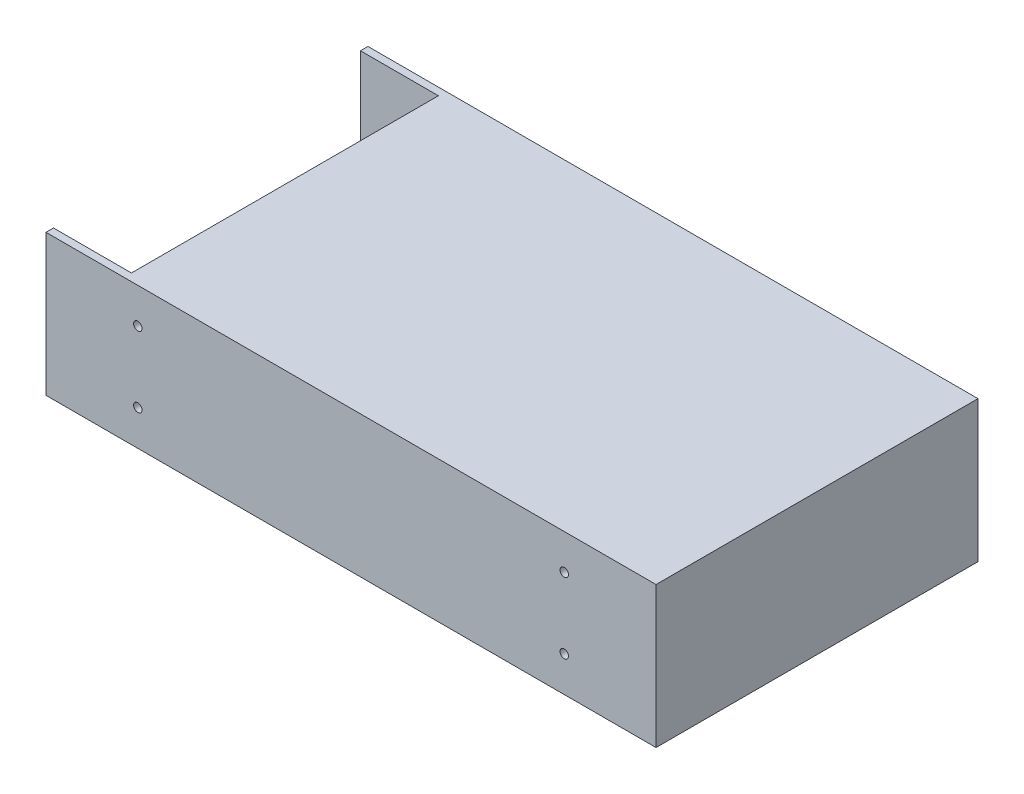
ISO-10303-21;
HEADER;
FILE_DESCRIPTION(('STEP AP214'),'2;1');
FILE_NAME('part.step','',(''),(''),'','','');
FILE_SCHEMA(('AUTOMOTIVE_DESIGN { 1 0 10303 214 1 1 1 1 }'));
ENDSEC;
DATA;
#1=APPLICATION_CONTEXT('core data for automotive mechanical design processes');
#2=APPLICATION_PROTOCOL_DEFINITION('international standard','automotive_design',2000,#1);
#3=PRODUCT_CONTEXT('',#1,'mechanical');
#4=PRODUCT('Part','Part','',(#3));
#5=PRODUCT_RELATED_PRODUCT_CATEGORY('part','',(#4));
#6=PRODUCT_DEFINITION_FORMATION('','',#4);
#7=PRODUCT_DEFINITION_CONTEXT('part definition',#1,'design');
#8=PRODUCT_DEFINITION('design','',#6,#7);
#9=PRODUCT_DEFINITION_SHAPE('','',#8);
#10=(LENGTH_UNIT() NAMED_UNIT(*) SI_UNIT(.MILLI.,.METRE.));
#11=(NAMED_UNIT(*) PLANE_ANGLE_UNIT() SI_UNIT($,.RADIAN.));
#12=(NAMED_UNIT(*) SI_UNIT($,.STERADIAN.) SOLID_ANGLE_UNIT());
#13=UNCERTAINTY_MEASURE_WITH_UNIT(LENGTH_MEASURE(1.E-05),#10,'distance_accuracy_value','');
#14=(GEOMETRIC_REPRESENTATION_CONTEXT(3) GLOBAL_UNCERTAINTY_ASSIGNED_CONTEXT((#13)) GLOBAL_UNIT_ASSIGNED_CONTEXT((#10,
#11,#12)) REPRESENTATION_CONTEXT('',''));
#15=CARTESIAN_POINT('',(0.,0.,0.));
#16=DIRECTION('',(0.,0.,1.));
#17=DIRECTION('',(1.,0.,0.));
#18=AXIS2_PLACEMENT_3D('',#15,#16,#17);
#19=CARTESIAN_POINT('',(0.,6.00000000000001,0.));
#20=DIRECTION('',(0.,1.,0.));
#21=DIRECTION('',(0.,0.,1.));
#22=AXIS2_PLACEMENT_3D('',#19,#20,#21);
#23=PLANE('',#22);
#24=DIRECTION('',(0.,0.,1.));
#25=VECTOR('',#24,1.);
#26=CARTESIAN_POINT('',(-108.,6.00000000000001,-54.3417067177277));
#27=LINE('',#26,#25);
#28=CARTESIAN_POINT('',(-108.,6.00000000000001,-54.3417067177277));
#29=VERTEX_POINT('',#28);
#30=CARTESIAN_POINT('',(-108.,6.00000000000001,54.3417067177274));
#31=VERTEX_POINT('',#30);
#32=EDGE_CURVE('E158',#29,#31,#27,.T.);
#33=ORIENTED_EDGE('',*,*,#32,.T.);
#34=DIRECTION('',(1.,0.,0.));
#35=VECTOR('',#34,1.);
#36=CARTESIAN_POINT('',(-108.,6.00000000000001,54.3417067177274));
#37=LINE('',#36,#35);
#38=CARTESIAN_POINT('',(-80.4048754072851,6.00000000000001,54.3417067177274));
#39=VERTEX_POINT('',#38);
#40=EDGE_CURVE('E161',#31,#39,#37,.T.);
#41=ORIENTED_EDGE('',*,*,#40,.T.);
#42=DIRECTION('',(0.,0.,-1.));
#43=VECTOR('',#42,1.);
#44=CARTESIAN_POINT('',(-80.4048754072851,6.00000000000001,-54.3417067177277));
#45=LINE('',#44,#43);
#46=CARTESIAN_POINT('',(-80.4048754072851,6.00000000000001,-54.3417067177277));
#47=VERTEX_POINT('',#46);
#48=EDGE_CURVE('E165',#39,#47,#45,.T.);
#49=ORIENTED_EDGE('',*,*,#48,.T.);
#50=DIRECTION('',(-1.,0.,0.));
#51=VECTOR('',#50,1.);
#52=CARTESIAN_POINT('',(-108.,6.00000000000001,-54.3417067177277));
#53=LINE('',#52,#51);
#54=EDGE_CURVE('E168',#47,#29,#53,.T.);
#55=ORIENTED_EDGE('',*,*,#54,.T.);
#56=EDGE_LOOP('',(#33,#41,#49,#55));
#57=FACE_BOUND('',#56,.T.);
#58=DIRECTION('',(1.,0.,0.));
#59=VECTOR('',#58,1.);
#60=CARTESIAN_POINT('',(-102.297937106513,6.00000000000001,47.5652828584427));
#61=LINE('',#60,#59);
#62=CARTESIAN_POINT('',(-102.297937106513,6.00000000000001,47.5652828584427));
#63=VERTEX_POINT('',#62);
#64=CARTESIAN_POINT('',(-86.9206675796744,6.00000000000001,47.5652828584427));
#65=VERTEX_POINT('',#64);
#66=EDGE_CURVE('E304',#63,#65,#61,.T.);
#67=ORIENTED_EDGE('',*,*,#66,.F.);
#68=DIRECTION('',(0.,0.,1.));
#69=VECTOR('',#68,1.);
#70=CARTESIAN_POINT('',(-102.297937106513,6.00000000000001,-47.825914545338));
#71=LINE('',#70,#69);
#72=CARTESIAN_POINT('',(-102.297937106513,6.00000000000001,-47.825914545338));
#73=VERTEX_POINT('',#72);
#74=EDGE_CURVE('E149',#73,#63,#71,.T.);
#75=ORIENTED_EDGE('',*,*,#74,.F.);
#76=DIRECTION('',(-1.,0.,0.));
#77=VECTOR('',#76,1.);
#78=CARTESIAN_POINT('',(-102.297937106513,6.00000000000001,-47.825914545338));
#79=LINE('',#78,#77);
#80=CARTESIAN_POINT('',(-86.9206675796744,6.00000000000001,-47.825914545338));
#81=VERTEX_POINT('',#80);
#82=EDGE_CURVE('E145',#81,#73,#79,.T.);
#83=ORIENTED_EDGE('',*,*,#82,.F.);
#84=DIRECTION('',(0.,0.,-1.));
#85=VECTOR('',#84,1.);
#86=CARTESIAN_POINT('',(-86.9206675796744,6.00000000000001,-47.825914545338));
#87=LINE('',#86,#85);
#88=EDGE_CURVE('E306',#65,#81,#87,.T.);
#89=ORIENTED_EDGE('',*,*,#88,.F.);
#90=EDGE_LOOP('',(#67,#75,#83,#89));
#91=FACE_BOUND('',#90,.T.);
#92=ADVANCED_FACE('F36',(#57,#91),#23,.T.);
#93=CARTESIAN_POINT('',(-108.,50.,-57.));
#94=DIRECTION('',(1.,0.,0.));
#95=DIRECTION('',(0.,0.,-1.));
#96=AXIS2_PLACEMENT_3D('',#93,#94,#95);
#97=PLANE('',#96);
#98=ORIENTED_EDGE('',*,*,#32,.F.);
#99=DIRECTION('',(0.,1.,0.));
#100=VECTOR('',#99,1.);
#101=CARTESIAN_POINT('',(-108.,6.00000000000001,-54.3417067177277));
#102=LINE('',#101,#100);
#103=CARTESIAN_POINT('',(-108.,50.,-54.3417067177277));
#104=VERTEX_POINT('',#103);
#105=EDGE_CURVE('E174',#29,#104,#102,.T.);
#106=ORIENTED_EDGE('',*,*,#105,.T.);
#107=DIRECTION('',(0.,0.,1.));
#108=VECTOR('',#107,1.);
#109=CARTESIAN_POINT('',(-108.,50.,-57.));
#110=LINE('',#109,#108);
#111=CARTESIAN_POINT('',(-108.,50.,-57.));
#112=VERTEX_POINT('',#111);
#113=EDGE_CURVE('E183',#112,#104,#110,.T.);
#114=ORIENTED_EDGE('',*,*,#113,.F.);
#115=DIRECTION('',(0.,-1.,0.));
#116=VECTOR('',#115,1.);
#117=CARTESIAN_POINT('',(-108.,50.,-57.));
#118=LINE('',#117,#116);
#119=CARTESIAN_POINT('',(-108.,0.,-57.));
#120=VERTEX_POINT('',#119);
#121=EDGE_CURVE('E193',#112,#120,#118,.T.);
#122=ORIENTED_EDGE('',*,*,#121,.T.);
#123=DIRECTION('',(0.,0.,1.));
#124=VECTOR('',#123,1.);
#125=CARTESIAN_POINT('',(-108.,0.,-57.));
#126=LINE('',#125,#124);
#127=CARTESIAN_POINT('',(-108.,0.,57.));
#128=VERTEX_POINT('',#127);
#129=EDGE_CURVE('E177',#120,#128,#126,.T.);
#130=ORIENTED_EDGE('',*,*,#129,.T.);
#131=DIRECTION('',(0.,-1.,0.));
#132=VECTOR('',#131,1.);
#133=CARTESIAN_POINT('',(-108.,50.,57.));
#134=LINE('',#133,#132);
#135=CARTESIAN_POINT('',(-108.,50.,57.));
#136=VERTEX_POINT('',#135);
#137=EDGE_CURVE('E11',#136,#128,#134,.T.);
#138=ORIENTED_EDGE('',*,*,#137,.F.);
#139=CARTESIAN_POINT('',(-108.,50.,54.3417067177274));
#140=VERTEX_POINT('',#139);
#141=EDGE_CURVE('E187',#140,#136,#110,.T.);
#142=ORIENTED_EDGE('',*,*,#141,.F.);
#143=DIRECTION('',(0.,1.,0.));
#144=VECTOR('',#143,1.);
#145=CARTESIAN_POINT('',(-108.,6.00000000000001,54.3417067177274));
#146=LINE('',#145,#144);
#147=EDGE_CURVE('E59',#31,#140,#146,.T.);
#148=ORIENTED_EDGE('',*,*,#147,.F.);
#149=EDGE_LOOP('',(#98,#106,#114,#122,#130,#138,#142,#148));
#150=FACE_BOUND('',#149,.T.);
#151=ADVANCED_FACE('F38',(#150),#97,.F.);
#152=CARTESIAN_POINT('',(-108.,50.,57.));
#153=DIRECTION('',(0.,0.,-1.));
#154=DIRECTION('',(-1.,0.,0.));
#155=AXIS2_PLACEMENT_3D('',#152,#153,#154);
#156=PLANE('',#155);
#157=CARTESIAN_POINT('',(-75.5,37.5,57.));
#158=DIRECTION('',(0.,0.,1.));
#159=DIRECTION('',(1.,0.,0.));
#160=AXIS2_PLACEMENT_3D('',#157,#158,#159);
#161=CIRCLE('',#160,1.5);
#162=CARTESIAN_POINT('',(-74.,37.5,57.));
#163=VERTEX_POINT('',#162);
#164=EDGE_CURVE('E278',#163,#163,#161,.T.);
#165=ORIENTED_EDGE('',*,*,#164,.F.);
#166=EDGE_LOOP('',(#165));
#167=FACE_BOUND('',#166,.T.);
#168=CARTESIAN_POINT('',(-75.5,12.5,57.));
#169=DIRECTION('',(0.,0.,1.));
#170=DIRECTION('',(1.,0.,0.));
#171=AXIS2_PLACEMENT_3D('',#168,#169,#170);
#172=CIRCLE('',#171,1.5);
#173=CARTESIAN_POINT('',(-74.,12.5,57.));
#174=VERTEX_POINT('',#173);
#175=EDGE_CURVE('E282',#174,#174,#172,.T.);
#176=ORIENTED_EDGE('',*,*,#175,.F.);
#177=EDGE_LOOP('',(#176));
#178=FACE_BOUND('',#177,.T.);
#179=CARTESIAN_POINT('',(75.5,12.5,57.));
#180=DIRECTION('',(0.,0.,1.));
#181=DIRECTION('',(1.,0.,0.));
#182=AXIS2_PLACEMENT_3D('',#179,#180,#181);
#183=CIRCLE('',#182,1.5);
#184=CARTESIAN_POINT('',(77.,12.5,57.));
#185=VERTEX_POINT('',#184);
#186=EDGE_CURVE('E286',#185,#185,#183,.T.);
#187=ORIENTED_EDGE('',*,*,#186,.F.);
#188=EDGE_LOOP('',(#187));
#189=FACE_BOUND('',#188,.T.);
#190=CARTESIAN_POINT('',(75.5,37.5,57.));
#191=DIRECTION('',(0.,0.,1.));
#192=DIRECTION('',(1.,0.,0.));
#193=AXIS2_PLACEMENT_3D('',#190,#191,#192);
#194=CIRCLE('',#193,1.5);
#195=CARTESIAN_POINT('',(77.,37.5,57.));
#196=VERTEX_POINT('',#195);
#197=EDGE_CURVE('E289',#196,#196,#194,.T.);
#198=ORIENTED_EDGE('',*,*,#197,.F.);
#199=EDGE_LOOP('',(#198));
#200=FACE_BOUND('',#199,.T.);
#201=DIRECTION('',(1.,0.,0.));
#202=VECTOR('',#201,1.);
#203=CARTESIAN_POINT('',(-108.,0.,57.));
#204=LINE('',#203,#202);
#205=CARTESIAN_POINT('',(108.,0.,57.));
#206=VERTEX_POINT('',#205);
#207=EDGE_CURVE('E196',#128,#206,#204,.T.);
#208=ORIENTED_EDGE('',*,*,#207,.T.);
#209=DIRECTION('',(0.,-1.,0.));
#210=VECTOR('',#209,1.);
#211=CARTESIAN_POINT('',(108.,50.,57.));
#212=LINE('',#211,#210);
#213=CARTESIAN_POINT('',(108.,50.,57.));
#214=VERTEX_POINT('',#213);
#215=EDGE_CURVE('E44',#214,#206,#212,.T.);
#216=ORIENTED_EDGE('',*,*,#215,.F.);
#217=DIRECTION('',(1.,0.,0.));
#218=VECTOR('',#217,1.);
#219=CARTESIAN_POINT('',(-108.,50.,57.));
#220=LINE('',#219,#218);
#221=EDGE_CURVE('E186',#136,#214,#220,.T.);
#222=ORIENTED_EDGE('',*,*,#221,.F.);
#223=ORIENTED_EDGE('',*,*,#137,.T.);
#224=EDGE_LOOP('',(#208,#216,#222,#223));
#225=FACE_BOUND('',#224,.T.);
#226=ADVANCED_FACE('F232',(#167,#178,#189,#200,#225),#156,.F.);
#227=CARTESIAN_POINT('',(108.,50.,-57.));
#228=DIRECTION('',(-1.,0.,0.));
#229=DIRECTION('',(0.,0.,1.));
#230=AXIS2_PLACEMENT_3D('',#227,#228,#229);
#231=PLANE('',#230);
#232=DIRECTION('',(0.,0.,-1.));
#233=VECTOR('',#232,1.);
#234=CARTESIAN_POINT('',(108.,0.,-57.));
#235=LINE('',#234,#233);
#236=CARTESIAN_POINT('',(108.,0.,-57.));
#237=VERTEX_POINT('',#236);
#238=EDGE_CURVE('E198',#206,#237,#235,.T.);
#239=ORIENTED_EDGE('',*,*,#238,.T.);
#240=DIRECTION('',(0.,-1.,0.));
#241=VECTOR('',#240,1.);
#242=CARTESIAN_POINT('',(108.,50.,-57.));
#243=LINE('',#242,#241);
#244=CARTESIAN_POINT('',(108.,50.,-57.));
#245=VERTEX_POINT('',#244);
#246=EDGE_CURVE('E204',#245,#237,#243,.T.);
#247=ORIENTED_EDGE('',*,*,#246,.F.);
#248=DIRECTION('',(0.,0.,-1.));
#249=VECTOR('',#248,1.);
#250=CARTESIAN_POINT('',(108.,50.,-57.));
#251=LINE('',#250,#249);
#252=EDGE_CURVE('E189',#214,#245,#251,.T.);
#253=ORIENTED_EDGE('',*,*,#252,.F.);
#254=ORIENTED_EDGE('',*,*,#215,.T.);
#255=EDGE_LOOP('',(#239,#247,#253,#254));
#256=FACE_BOUND('',#255,.T.);
#257=ADVANCED_FACE('F211',(#256),#231,.F.);
#258=CARTESIAN_POINT('',(-108.,50.,-57.));
#259=DIRECTION('',(0.,0.,1.));
#260=DIRECTION('',(1.,0.,0.));
#261=AXIS2_PLACEMENT_3D('',#258,#259,#260);
#262=PLANE('',#261);
#263=CARTESIAN_POINT('',(-75.5,37.5,-57.));
#264=DIRECTION('',(0.,0.,1.));
#265=DIRECTION('',(1.,0.,0.));
#266=AXIS2_PLACEMENT_3D('',#263,#264,#265);
#267=CIRCLE('',#266,1.5);
#268=CARTESIAN_POINT('',(-74.,37.5,-57.));
#269=VERTEX_POINT('',#268);
#270=EDGE_CURVE('E401',#269,#269,#267,.T.);
#271=ORIENTED_EDGE('',*,*,#270,.T.);
#272=EDGE_LOOP('',(#271));
#273=FACE_BOUND('',#272,.T.);
#274=CARTESIAN_POINT('',(-75.5,12.5,-57.));
#275=DIRECTION('',(0.,0.,1.));
#276=DIRECTION('',(1.,0.,0.));
#277=AXIS2_PLACEMENT_3D('',#274,#275,#276);
#278=CIRCLE('',#277,1.5);
#279=CARTESIAN_POINT('',(-74.,12.5,-57.));
#280=VERTEX_POINT('',#279);
#281=EDGE_CURVE('E405',#280,#280,#278,.T.);
#282=ORIENTED_EDGE('',*,*,#281,.T.);
#283=EDGE_LOOP('',(#282));
#284=FACE_BOUND('',#283,.T.);
#285=CARTESIAN_POINT('',(75.5,12.5,-57.));
#286=DIRECTION('',(0.,0.,1.));
#287=DIRECTION('',(1.,0.,0.));
#288=AXIS2_PLACEMENT_3D('',#285,#286,#287);
#289=CIRCLE('',#288,1.5);
#290=CARTESIAN_POINT('',(77.,12.5,-57.));
#291=VERTEX_POINT('',#290);
#292=EDGE_CURVE('E292',#291,#291,#289,.T.);
#293=ORIENTED_EDGE('',*,*,#292,.T.);
#294=EDGE_LOOP('',(#293));
#295=FACE_BOUND('',#294,.T.);
#296=CARTESIAN_POINT('',(75.5,37.5,-57.));
#297=DIRECTION('',(0.,0.,1.));
#298=DIRECTION('',(1.,0.,0.));
#299=AXIS2_PLACEMENT_3D('',#296,#297,#298);
#300=CIRCLE('',#299,1.5);
#301=CARTESIAN_POINT('',(77.,37.5,-57.));
#302=VERTEX_POINT('',#301);
#303=EDGE_CURVE('E291',#302,#302,#300,.T.);
#304=ORIENTED_EDGE('',*,*,#303,.T.);
#305=EDGE_LOOP('',(#304));
#306=FACE_BOUND('',#305,.T.);
#307=DIRECTION('',(-1.,0.,0.));
#308=VECTOR('',#307,1.);
#309=CARTESIAN_POINT('',(-108.,0.,-57.));
#310=LINE('',#309,#308);
#311=EDGE_CURVE('E200',#237,#120,#310,.T.);
#312=ORIENTED_EDGE('',*,*,#311,.T.);
#313=ORIENTED_EDGE('',*,*,#121,.F.);
#314=DIRECTION('',(-1.,0.,0.));
#315=VECTOR('',#314,1.);
#316=CARTESIAN_POINT('',(-108.,50.,-57.));
#317=LINE('',#316,#315);
#318=EDGE_CURVE('E191',#245,#112,#317,.T.);
#319=ORIENTED_EDGE('',*,*,#318,.F.);
#320=ORIENTED_EDGE('',*,*,#246,.T.);
#321=EDGE_LOOP('',(#312,#313,#319,#320));
#322=FACE_BOUND('',#321,.T.);
#323=ADVANCED_FACE('F221',(#273,#284,#295,#306,#322),#262,.F.);
#324=CARTESIAN_POINT('',(0.,50.,0.));
#325=DIRECTION('',(0.,1.,0.));
#326=DIRECTION('',(0.,0.,1.));
#327=AXIS2_PLACEMENT_3D('',#324,#325,#326);
#328=PLANE('',#327);
#329=DIRECTION('',(-1.,0.,0.));
#330=VECTOR('',#329,1.);
#331=CARTESIAN_POINT('',(-108.,50.,-54.3417067177277));
#332=LINE('',#331,#330);
#333=CARTESIAN_POINT('',(-80.4048754072851,50.,-54.3417067177277));
#334=VERTEX_POINT('',#333);
#335=EDGE_CURVE('E162',#334,#104,#332,.T.);
#336=ORIENTED_EDGE('',*,*,#335,.F.);
#337=DIRECTION('',(0.,0.,-1.));
#338=VECTOR('',#337,1.);
#339=CARTESIAN_POINT('',(-80.4048754072851,50.,-54.3417067177277));
#340=LINE('',#339,#338);
#341=CARTESIAN_POINT('',(-80.4048754072851,50.,54.3417067177274));
#342=VERTEX_POINT('',#341);
#343=EDGE_CURVE('E153',#342,#334,#340,.T.);
#344=ORIENTED_EDGE('',*,*,#343,.F.);
#345=DIRECTION('',(1.,0.,0.));
#346=VECTOR('',#345,1.);
#347=CARTESIAN_POINT('',(-108.,50.,54.3417067177274));
#348=LINE('',#347,#346);
#349=EDGE_CURVE('E151',#140,#342,#348,.T.);
#350=ORIENTED_EDGE('',*,*,#349,.F.);
#351=ORIENTED_EDGE('',*,*,#141,.T.);
#352=ORIENTED_EDGE('',*,*,#221,.T.);
#353=ORIENTED_EDGE('',*,*,#252,.T.);
#354=ORIENTED_EDGE('',*,*,#318,.T.);
#355=ORIENTED_EDGE('',*,*,#113,.T.);
#356=EDGE_LOOP('',(#336,#344,#350,#351,#352,#353,#354,#355));
#357=FACE_BOUND('',#356,.T.);
#358=ADVANCED_FACE('F229',(#357),#328,.T.);
#359=CARTESIAN_POINT('',(0.,0.,0.));
#360=DIRECTION('',(0.,1.,0.));
#361=DIRECTION('',(0.,0.,1.));
#362=AXIS2_PLACEMENT_3D('',#359,#360,#361);
#363=PLANE('',#362);
#364=ORIENTED_EDGE('',*,*,#129,.F.);
#365=ORIENTED_EDGE('',*,*,#311,.F.);
#366=ORIENTED_EDGE('',*,*,#238,.F.);
#367=ORIENTED_EDGE('',*,*,#207,.F.);
#368=EDGE_LOOP('',(#364,#365,#366,#367));
#369=FACE_BOUND('',#368,.T.);
#370=ADVANCED_FACE('F218',(#369),#363,.F.);
#371=CARTESIAN_POINT('',(-108.,6.00000000000001,-54.3417067177277));
#372=DIRECTION('',(0.,0.,-1.));
#373=DIRECTION('',(-1.,0.,0.));
#374=AXIS2_PLACEMENT_3D('',#371,#372,#373);
#375=PLANE('',#374);
#376=ORIENTED_EDGE('',*,*,#335,.T.);
#377=ORIENTED_EDGE('',*,*,#105,.F.);
#378=ORIENTED_EDGE('',*,*,#54,.F.);
#379=DIRECTION('',(0.,1.,0.));
#380=VECTOR('',#379,1.);
#381=CARTESIAN_POINT('',(-80.4048754072851,6.00000000000001,-54.3417067177277));
#382=LINE('',#381,#380);
#383=EDGE_CURVE('E178',#47,#334,#382,.T.);
#384=ORIENTED_EDGE('',*,*,#383,.T.);
#385=EDGE_LOOP('',(#376,#377,#378,#384));
#386=FACE_BOUND('',#385,.T.);
#387=ADVANCED_FACE('F238',(#386),#375,.F.);
#388=CARTESIAN_POINT('',(-80.4048754072851,6.00000000000001,-54.3417067177277));
#389=DIRECTION('',(1.,0.,0.));
#390=DIRECTION('',(0.,0.,-1.));
#391=AXIS2_PLACEMENT_3D('',#388,#389,#390);
#392=PLANE('',#391);
#393=ORIENTED_EDGE('',*,*,#343,.T.);
#394=ORIENTED_EDGE('',*,*,#383,.F.);
#395=ORIENTED_EDGE('',*,*,#48,.F.);
#396=DIRECTION('',(0.,1.,0.));
#397=VECTOR('',#396,1.);
#398=CARTESIAN_POINT('',(-80.4048754072851,6.00000000000001,54.3417067177274));
#399=LINE('',#398,#397);
#400=EDGE_CURVE('E180',#39,#342,#399,.T.);
#401=ORIENTED_EDGE('',*,*,#400,.T.);
#402=EDGE_LOOP('',(#393,#394,#395,#401));
#403=FACE_BOUND('',#402,.T.);
#404=ADVANCED_FACE('F240',(#403),#392,.F.);
#405=CARTESIAN_POINT('',(-108.,6.00000000000001,54.3417067177274));
#406=DIRECTION('',(0.,0.,1.));
#407=DIRECTION('',(1.,0.,0.));
#408=AXIS2_PLACEMENT_3D('',#405,#406,#407);
#409=PLANE('',#408);
#410=ORIENTED_EDGE('',*,*,#349,.T.);
#411=ORIENTED_EDGE('',*,*,#400,.F.);
#412=ORIENTED_EDGE('',*,*,#40,.F.);
#413=ORIENTED_EDGE('',*,*,#147,.T.);
#414=EDGE_LOOP('',(#410,#411,#412,#413));
#415=FACE_BOUND('',#414,.T.);
#416=ADVANCED_FACE('F241',(#415),#409,.F.);
#417=CARTESIAN_POINT('',(-102.297937106513,16.,-47.825914545338));
#418=DIRECTION('',(1.,0.,0.));
#419=DIRECTION('',(0.,0.,-1.));
#420=AXIS2_PLACEMENT_3D('',#417,#418,#419);
#421=PLANE('',#420);
#422=ORIENTED_EDGE('',*,*,#74,.T.);
#423=DIRECTION('',(0.,-1.,0.));
#424=VECTOR('',#423,1.);
#425=CARTESIAN_POINT('',(-102.297937106513,16.,47.5652828584427));
#426=LINE('',#425,#424);
#427=CARTESIAN_POINT('',(-102.297937106513,16.,47.5652828584427));
#428=VERTEX_POINT('',#427);
#429=EDGE_CURVE('E130',#428,#63,#426,.T.);
#430=ORIENTED_EDGE('',*,*,#429,.F.);
#431=DIRECTION('',(0.,0.,1.));
#432=VECTOR('',#431,1.);
#433=CARTESIAN_POINT('',(-102.297937106513,16.,-47.825914545338));
#434=LINE('',#433,#432);
#435=CARTESIAN_POINT('',(-102.297937106513,16.,-47.825914545338));
#436=VERTEX_POINT('',#435);
#437=EDGE_CURVE('E137',#436,#428,#434,.T.);
#438=ORIENTED_EDGE('',*,*,#437,.F.);
#439=DIRECTION('',(0.,-1.,0.));
#440=VECTOR('',#439,1.);
#441=CARTESIAN_POINT('',(-102.297937106513,16.,-47.825914545338));
#442=LINE('',#441,#440);
#443=EDGE_CURVE('E302',#436,#73,#442,.T.);
#444=ORIENTED_EDGE('',*,*,#443,.T.);
#445=EDGE_LOOP('',(#422,#430,#438,#444));
#446=FACE_BOUND('',#445,.T.);
#447=ADVANCED_FACE('F147',(#446),#421,.F.);
#448=CARTESIAN_POINT('',(-102.297937106513,16.,47.5652828584427));
#449=DIRECTION('',(0.,0.,-1.));
#450=DIRECTION('',(-1.,0.,0.));
#451=AXIS2_PLACEMENT_3D('',#448,#449,#450);
#452=PLANE('',#451);
#453=ORIENTED_EDGE('',*,*,#66,.T.);
#454=DIRECTION('',(0.,-1.,0.));
#455=VECTOR('',#454,1.);
#456=CARTESIAN_POINT('',(-86.9206675796744,16.,47.5652828584427));
#457=LINE('',#456,#455);
#458=CARTESIAN_POINT('',(-86.9206675796744,16.,47.5652828584427));
#459=VERTEX_POINT('',#458);
#460=EDGE_CURVE('E133',#459,#65,#457,.T.);
#461=ORIENTED_EDGE('',*,*,#460,.F.);
#462=DIRECTION('',(1.,0.,0.));
#463=VECTOR('',#462,1.);
#464=CARTESIAN_POINT('',(-102.297937106513,16.,47.5652828584427));
#465=LINE('',#464,#463);
#466=EDGE_CURVE('E126',#428,#459,#465,.T.);
#467=ORIENTED_EDGE('',*,*,#466,.F.);
#468=ORIENTED_EDGE('',*,*,#429,.T.);
#469=EDGE_LOOP('',(#453,#461,#467,#468));
#470=FACE_BOUND('',#469,.T.);
#471=ADVANCED_FACE('F128',(#470),#452,.F.);
#472=CARTESIAN_POINT('',(-86.9206675796744,16.,-47.825914545338));
#473=DIRECTION('',(-1.,0.,0.));
#474=DIRECTION('',(0.,0.,1.));
#475=AXIS2_PLACEMENT_3D('',#472,#473,#474);
#476=PLANE('',#475);
#477=ORIENTED_EDGE('',*,*,#88,.T.);
#478=DIRECTION('',(0.,-1.,0.));
#479=VECTOR('',#478,1.);
#480=CARTESIAN_POINT('',(-86.9206675796744,16.,-47.825914545338));
#481=LINE('',#480,#479);
#482=CARTESIAN_POINT('',(-86.9206675796744,16.,-47.825914545338));
#483=VERTEX_POINT('',#482);
#484=EDGE_CURVE('E51',#483,#81,#481,.T.);
#485=ORIENTED_EDGE('',*,*,#484,.F.);
#486=DIRECTION('',(0.,0.,-1.));
#487=VECTOR('',#486,1.);
#488=CARTESIAN_POINT('',(-86.9206675796744,16.,-47.825914545338));
#489=LINE('',#488,#487);
#490=EDGE_CURVE('E136',#459,#483,#489,.T.);
#491=ORIENTED_EDGE('',*,*,#490,.F.);
#492=ORIENTED_EDGE('',*,*,#460,.T.);
#493=EDGE_LOOP('',(#477,#485,#491,#492));
#494=FACE_BOUND('',#493,.T.);
#495=ADVANCED_FACE('F312',(#494),#476,.F.);
#496=CARTESIAN_POINT('',(-102.297937106513,16.,-47.825914545338));
#497=DIRECTION('',(0.,0.,1.));
#498=DIRECTION('',(1.,0.,0.));
#499=AXIS2_PLACEMENT_3D('',#496,#497,#498);
#500=PLANE('',#499);
#501=ORIENTED_EDGE('',*,*,#82,.T.);
#502=ORIENTED_EDGE('',*,*,#443,.F.);
#503=DIRECTION('',(-1.,0.,0.));
#504=VECTOR('',#503,1.);
#505=CARTESIAN_POINT('',(-102.297937106513,16.,-47.825914545338));
#506=LINE('',#505,#504);
#507=EDGE_CURVE('E141',#483,#436,#506,.T.);
#508=ORIENTED_EDGE('',*,*,#507,.F.);
#509=ORIENTED_EDGE('',*,*,#484,.T.);
#510=EDGE_LOOP('',(#501,#502,#508,#509));
#511=FACE_BOUND('',#510,.T.);
#512=ADVANCED_FACE('F313',(#511),#500,.F.);
#513=CARTESIAN_POINT('',(0.,16.,0.));
#514=DIRECTION('',(0.,1.,0.));
#515=DIRECTION('',(0.,0.,1.));
#516=AXIS2_PLACEMENT_3D('',#513,#514,#515);
#517=PLANE('',#516);
#518=ORIENTED_EDGE('',*,*,#437,.T.);
#519=ORIENTED_EDGE('',*,*,#466,.T.);
#520=ORIENTED_EDGE('',*,*,#490,.T.);
#521=ORIENTED_EDGE('',*,*,#507,.T.);
#522=EDGE_LOOP('',(#518,#519,#520,#521));
#523=FACE_BOUND('',#522,.T.);
#524=ADVANCED_FACE('F140',(#523),#517,.T.);
#525=CARTESIAN_POINT('',(75.5,37.5,-57.));
#526=DIRECTION('',(0.,0.,1.));
#527=DIRECTION('',(1.,0.,0.));
#528=AXIS2_PLACEMENT_3D('',#525,#526,#527);
#529=CYLINDRICAL_SURFACE('',#528,1.5);
#530=ORIENTED_EDGE('',*,*,#303,.F.);
#531=EDGE_LOOP('',(#530));
#532=FACE_BOUND('',#531,.T.);
#533=ORIENTED_EDGE('',*,*,#197,.T.);
#534=EDGE_LOOP('',(#533));
#535=FACE_BOUND('',#534,.T.);
#536=ADVANCED_FACE('F320',(#532,#535),#529,.F.);
#537=CARTESIAN_POINT('',(75.5,12.5,-57.));
#538=DIRECTION('',(0.,0.,1.));
#539=DIRECTION('',(1.,0.,0.));
#540=AXIS2_PLACEMENT_3D('',#537,#538,#539);
#541=CYLINDRICAL_SURFACE('',#540,1.5);
#542=ORIENTED_EDGE('',*,*,#292,.F.);
#543=EDGE_LOOP('',(#542));
#544=FACE_BOUND('',#543,.T.);
#545=ORIENTED_EDGE('',*,*,#186,.T.);
#546=EDGE_LOOP('',(#545));
#547=FACE_BOUND('',#546,.T.);
#548=ADVANCED_FACE('F365',(#544,#547),#541,.F.);
#549=CARTESIAN_POINT('',(-75.5,12.5,-57.));
#550=DIRECTION('',(0.,0.,1.));
#551=DIRECTION('',(1.,0.,0.));
#552=AXIS2_PLACEMENT_3D('',#549,#550,#551);
#553=CYLINDRICAL_SURFACE('',#552,1.5);
#554=ORIENTED_EDGE('',*,*,#281,.F.);
#555=EDGE_LOOP('',(#554));
#556=FACE_BOUND('',#555,.T.);
#557=ORIENTED_EDGE('',*,*,#175,.T.);
#558=EDGE_LOOP('',(#557));
#559=FACE_BOUND('',#558,.T.);
#560=ADVANCED_FACE('F374',(#556,#559),#553,.F.);
#561=CARTESIAN_POINT('',(-75.5,37.5,-57.));
#562=DIRECTION('',(0.,0.,1.));
#563=DIRECTION('',(1.,0.,0.));
#564=AXIS2_PLACEMENT_3D('',#561,#562,#563);
#565=CYLINDRICAL_SURFACE('',#564,1.5);
#566=ORIENTED_EDGE('',*,*,#270,.F.);
#567=EDGE_LOOP('',(#566));
#568=FACE_BOUND('',#567,.T.);
#569=ORIENTED_EDGE('',*,*,#164,.T.);
#570=EDGE_LOOP('',(#569));
#571=FACE_BOUND('',#570,.T.);
#572=ADVANCED_FACE('F384',(#568,#571),#565,.F.);
#573=CLOSED_SHELL('',(#92,#151,#226,#257,#323,#358,#370,#387,#404,#416,#447,#471,#495,#512,#524,
#536,#548,#560,#572));
#574=MANIFOLD_SOLID_BREP('B2',#573);
#575=ADVANCED_BREP_SHAPE_REPRESENTATION('',(#18,#574),#14);
#576=SHAPE_DEFINITION_REPRESENTATION(#9,#575);
ENDSEC;
END-ISO-10303-21;
